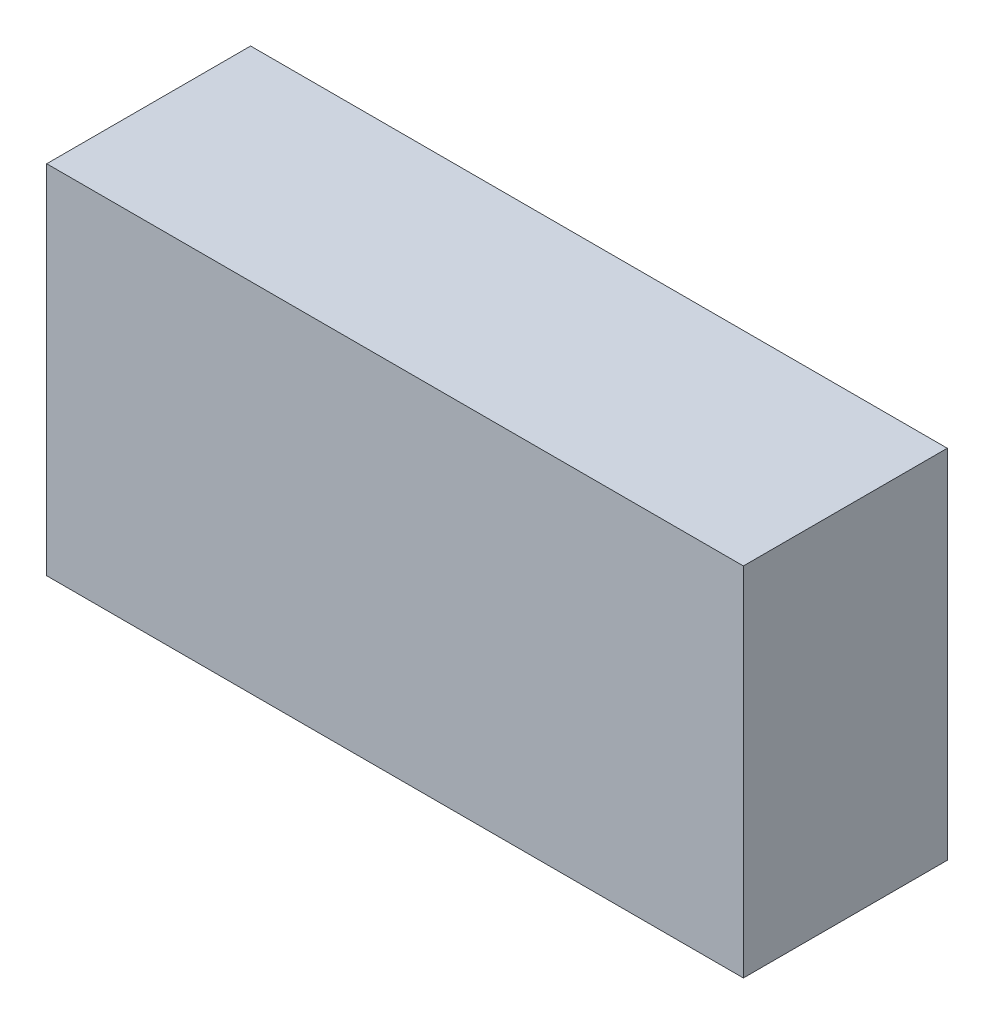
ISO-10303-21;
HEADER;
FILE_DESCRIPTION(('STEP AP214'),'2;1');
FILE_NAME('part.step','',(''),(''),'','','');
FILE_SCHEMA(('AUTOMOTIVE_DESIGN { 1 0 10303 214 1 1 1 1 }'));
ENDSEC;
DATA;
#1=APPLICATION_CONTEXT('core data for automotive mechanical design processes');
#2=APPLICATION_PROTOCOL_DEFINITION('international standard','automotive_design',2000,#1);
#3=PRODUCT_CONTEXT('',#1,'mechanical');
#4=PRODUCT('Part','Part','',(#3));
#5=PRODUCT_RELATED_PRODUCT_CATEGORY('part','',(#4));
#6=PRODUCT_DEFINITION_FORMATION('','',#4);
#7=PRODUCT_DEFINITION_CONTEXT('part definition',#1,'design');
#8=PRODUCT_DEFINITION('design','',#6,#7);
#9=PRODUCT_DEFINITION_SHAPE('','',#8);
#10=(LENGTH_UNIT() NAMED_UNIT(*) SI_UNIT(.MILLI.,.METRE.));
#11=(NAMED_UNIT(*) PLANE_ANGLE_UNIT() SI_UNIT($,.RADIAN.));
#12=(NAMED_UNIT(*) SI_UNIT($,.STERADIAN.) SOLID_ANGLE_UNIT());
#13=UNCERTAINTY_MEASURE_WITH_UNIT(LENGTH_MEASURE(1.E-05),#10,'distance_accuracy_value','');
#14=(GEOMETRIC_REPRESENTATION_CONTEXT(3) GLOBAL_UNCERTAINTY_ASSIGNED_CONTEXT((#13)) GLOBAL_UNIT_ASSIGNED_CONTEXT((#10,
#11,#12)) REPRESENTATION_CONTEXT('',''));
#15=CARTESIAN_POINT('',(0.,0.,0.));
#16=DIRECTION('',(0.,0.,1.));
#17=DIRECTION('',(1.,0.,0.));
#18=AXIS2_PLACEMENT_3D('',#15,#16,#17);
#19=CARTESIAN_POINT('',(0.,0.,12.));
#20=DIRECTION('',(1.,0.,0.));
#21=DIRECTION('',(0.,1.,0.));
#22=AXIS2_PLACEMENT_3D('',#19,#20,#21);
#23=PLANE('',#22);
#24=DIRECTION('',(0.,-1.,0.));
#25=VECTOR('',#24,1.);
#26=CARTESIAN_POINT('',(0.,0.,0.));
#27=LINE('',#26,#25);
#28=CARTESIAN_POINT('',(0.,21.,0.));
#29=VERTEX_POINT('',#28);
#30=CARTESIAN_POINT('',(0.,0.,0.));
#31=VERTEX_POINT('',#30);
#32=EDGE_CURVE('E107',#29,#31,#27,.T.);
#33=ORIENTED_EDGE('',*,*,#32,.T.);
#34=DIRECTION('',(0.,0.,-1.));
#35=VECTOR('',#34,1.);
#36=CARTESIAN_POINT('',(0.,0.,12.));
#37=LINE('',#36,#35);
#38=CARTESIAN_POINT('',(0.,0.,12.));
#39=VERTEX_POINT('',#38);
#40=EDGE_CURVE('E11',#39,#31,#37,.T.);
#41=ORIENTED_EDGE('',*,*,#40,.F.);
#42=DIRECTION('',(0.,-1.,0.));
#43=VECTOR('',#42,1.);
#44=CARTESIAN_POINT('',(0.,0.,12.));
#45=LINE('',#44,#43);
#46=CARTESIAN_POINT('',(0.,21.,12.));
#47=VERTEX_POINT('',#46);
#48=EDGE_CURVE('E91',#47,#39,#45,.T.);
#49=ORIENTED_EDGE('',*,*,#48,.F.);
#50=DIRECTION('',(0.,0.,-1.));
#51=VECTOR('',#50,1.);
#52=CARTESIAN_POINT('',(0.,21.,12.));
#53=LINE('',#52,#51);
#54=EDGE_CURVE('E103',#47,#29,#53,.T.);
#55=ORIENTED_EDGE('',*,*,#54,.T.);
#56=EDGE_LOOP('',(#33,#41,#49,#55));
#57=FACE_BOUND('',#56,.T.);
#58=ADVANCED_FACE('F39',(#57),#23,.F.);
#59=CARTESIAN_POINT('',(0.,0.,12.));
#60=DIRECTION('',(0.,1.,0.));
#61=DIRECTION('',(0.,0.,1.));
#62=AXIS2_PLACEMENT_3D('',#59,#60,#61);
#63=PLANE('',#62);
#64=DIRECTION('',(1.,0.,0.));
#65=VECTOR('',#64,1.);
#66=CARTESIAN_POINT('',(0.,0.,0.));
#67=LINE('',#66,#65);
#68=CARTESIAN_POINT('',(41.,0.,0.));
#69=VERTEX_POINT('',#68);
#70=EDGE_CURVE('E96',#31,#69,#67,.T.);
#71=ORIENTED_EDGE('',*,*,#70,.T.);
#72=DIRECTION('',(0.,0.,-1.));
#73=VECTOR('',#72,1.);
#74=CARTESIAN_POINT('',(41.,0.,12.));
#75=LINE('',#74,#73);
#76=CARTESIAN_POINT('',(41.,0.,12.));
#77=VERTEX_POINT('',#76);
#78=EDGE_CURVE('E48',#77,#69,#75,.T.);
#79=ORIENTED_EDGE('',*,*,#78,.F.);
#80=DIRECTION('',(1.,0.,0.));
#81=VECTOR('',#80,1.);
#82=CARTESIAN_POINT('',(0.,0.,12.));
#83=LINE('',#82,#81);
#84=EDGE_CURVE('E86',#39,#77,#83,.T.);
#85=ORIENTED_EDGE('',*,*,#84,.F.);
#86=ORIENTED_EDGE('',*,*,#40,.T.);
#87=EDGE_LOOP('',(#71,#79,#85,#86));
#88=FACE_BOUND('',#87,.T.);
#89=ADVANCED_FACE('F95',(#88),#63,.F.);
#90=CARTESIAN_POINT('',(41.,0.,12.));
#91=DIRECTION('',(-1.,0.,0.));
#92=DIRECTION('',(0.,-1.,0.));
#93=AXIS2_PLACEMENT_3D('',#90,#91,#92);
#94=PLANE('',#93);
#95=DIRECTION('',(0.,1.,0.));
#96=VECTOR('',#95,1.);
#97=CARTESIAN_POINT('',(41.,0.,0.));
#98=LINE('',#97,#96);
#99=CARTESIAN_POINT('',(41.,21.,0.));
#100=VERTEX_POINT('',#99);
#101=EDGE_CURVE('E73',#69,#100,#98,.T.);
#102=ORIENTED_EDGE('',*,*,#101,.T.);
#103=DIRECTION('',(0.,0.,-1.));
#104=VECTOR('',#103,1.);
#105=CARTESIAN_POINT('',(41.,21.,12.));
#106=LINE('',#105,#104);
#107=CARTESIAN_POINT('',(41.,21.,12.));
#108=VERTEX_POINT('',#107);
#109=EDGE_CURVE('E98',#108,#100,#106,.T.);
#110=ORIENTED_EDGE('',*,*,#109,.F.);
#111=DIRECTION('',(0.,1.,0.));
#112=VECTOR('',#111,1.);
#113=CARTESIAN_POINT('',(41.,0.,12.));
#114=LINE('',#113,#112);
#115=EDGE_CURVE('E89',#77,#108,#114,.T.);
#116=ORIENTED_EDGE('',*,*,#115,.F.);
#117=ORIENTED_EDGE('',*,*,#78,.T.);
#118=EDGE_LOOP('',(#102,#110,#116,#117));
#119=FACE_BOUND('',#118,.T.);
#120=ADVANCED_FACE('F99',(#119),#94,.F.);
#121=CARTESIAN_POINT('',(0.,21.,12.));
#122=DIRECTION('',(0.,-1.,0.));
#123=DIRECTION('',(0.,0.,-1.));
#124=AXIS2_PLACEMENT_3D('',#121,#122,#123);
#125=PLANE('',#124);
#126=DIRECTION('',(-1.,0.,0.));
#127=VECTOR('',#126,1.);
#128=CARTESIAN_POINT('',(0.,21.,0.));
#129=LINE('',#128,#127);
#130=EDGE_CURVE('E79',#100,#29,#129,.T.);
#131=ORIENTED_EDGE('',*,*,#130,.T.);
#132=ORIENTED_EDGE('',*,*,#54,.F.);
#133=DIRECTION('',(-1.,0.,0.));
#134=VECTOR('',#133,1.);
#135=CARTESIAN_POINT('',(0.,21.,12.));
#136=LINE('',#135,#134);
#137=EDGE_CURVE('E56',#108,#47,#136,.T.);
#138=ORIENTED_EDGE('',*,*,#137,.F.);
#139=ORIENTED_EDGE('',*,*,#109,.T.);
#140=EDGE_LOOP('',(#131,#132,#138,#139));
#141=FACE_BOUND('',#140,.T.);
#142=ADVANCED_FACE('F120',(#141),#125,.F.);
#143=CARTESIAN_POINT('',(0.,0.,12.));
#144=DIRECTION('',(0.,0.,-1.));
#145=DIRECTION('',(-1.,0.,0.));
#146=AXIS2_PLACEMENT_3D('',#143,#144,#145);
#147=PLANE('',#146);
#148=ORIENTED_EDGE('',*,*,#48,.T.);
#149=ORIENTED_EDGE('',*,*,#84,.T.);
#150=ORIENTED_EDGE('',*,*,#115,.T.);
#151=ORIENTED_EDGE('',*,*,#137,.T.);
#152=EDGE_LOOP('',(#148,#149,#150,#151));
#153=FACE_BOUND('',#152,.T.);
#154=ADVANCED_FACE('F87',(#153),#147,.F.);
#155=CARTESIAN_POINT('',(0.,0.,0.));
#156=DIRECTION('',(0.,0.,-1.));
#157=DIRECTION('',(-1.,0.,0.));
#158=AXIS2_PLACEMENT_3D('',#155,#156,#157);
#159=PLANE('',#158);
#160=ORIENTED_EDGE('',*,*,#32,.F.);
#161=ORIENTED_EDGE('',*,*,#130,.F.);
#162=ORIENTED_EDGE('',*,*,#101,.F.);
#163=ORIENTED_EDGE('',*,*,#70,.F.);
#164=EDGE_LOOP('',(#160,#161,#162,#163));
#165=FACE_BOUND('',#164,.T.);
#166=ADVANCED_FACE('F123',(#165),#159,.T.);
#167=CLOSED_SHELL('',(#58,#89,#120,#142,#154,#166));
#168=MANIFOLD_SOLID_BREP('B2',#167);
#169=ADVANCED_BREP_SHAPE_REPRESENTATION('',(#18,#168),#14);
#170=SHAPE_DEFINITION_REPRESENTATION(#9,#169);
ENDSEC;
END-ISO-10303-21;
